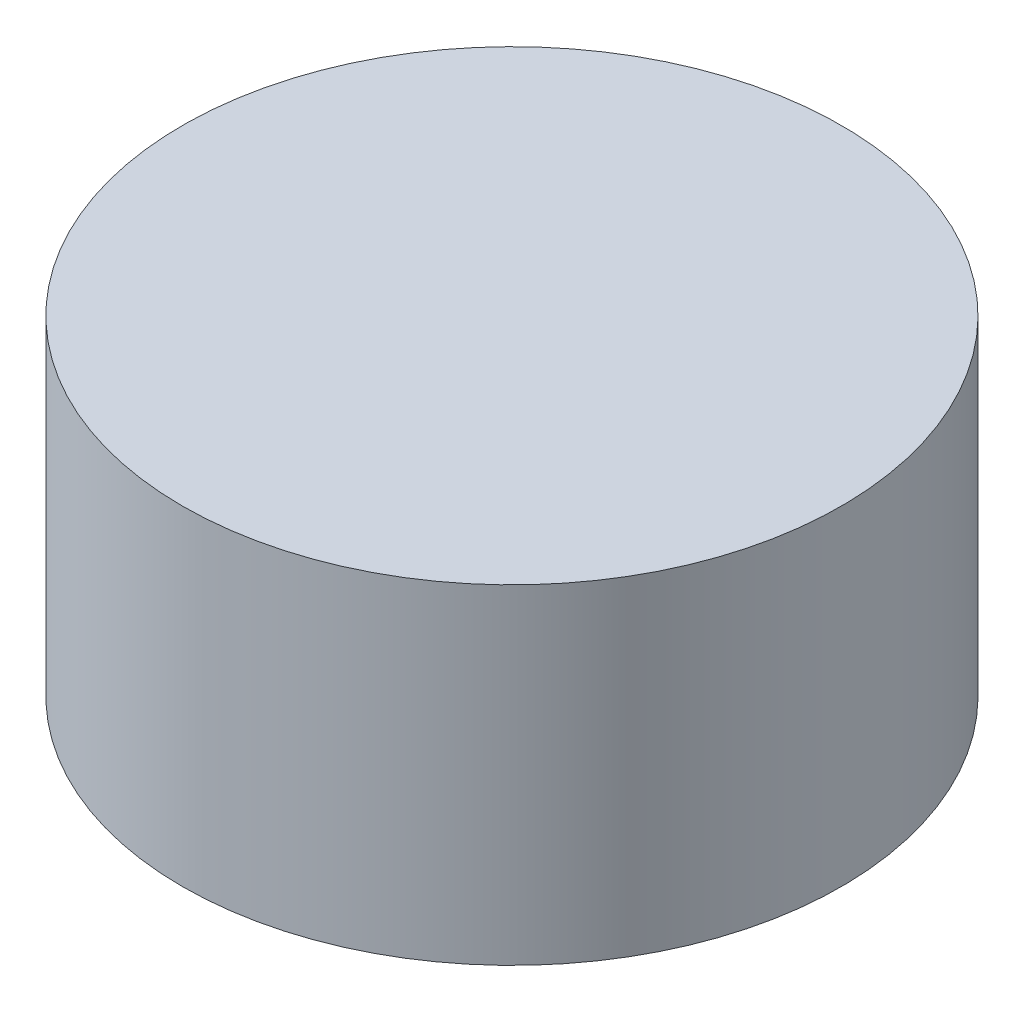
ISO-10303-21;
HEADER;
FILE_DESCRIPTION(('STEP AP214'),'2;1');
FILE_NAME('part.step','',(''),(''),'','','');
FILE_SCHEMA(('AUTOMOTIVE_DESIGN { 1 0 10303 214 1 1 1 1 }'));
ENDSEC;
DATA;
#1=APPLICATION_CONTEXT('core data for automotive mechanical design processes');
#2=APPLICATION_PROTOCOL_DEFINITION('international standard','automotive_design',2000,#1);
#3=PRODUCT_CONTEXT('',#1,'mechanical');
#4=PRODUCT('Part','Part','',(#3));
#5=PRODUCT_RELATED_PRODUCT_CATEGORY('part','',(#4));
#6=PRODUCT_DEFINITION_FORMATION('','',#4);
#7=PRODUCT_DEFINITION_CONTEXT('part definition',#1,'design');
#8=PRODUCT_DEFINITION('design','',#6,#7);
#9=PRODUCT_DEFINITION_SHAPE('','',#8);
#10=(LENGTH_UNIT() NAMED_UNIT(*) SI_UNIT(.MILLI.,.METRE.));
#11=(NAMED_UNIT(*) PLANE_ANGLE_UNIT() SI_UNIT($,.RADIAN.));
#12=(NAMED_UNIT(*) SI_UNIT($,.STERADIAN.) SOLID_ANGLE_UNIT());
#13=UNCERTAINTY_MEASURE_WITH_UNIT(LENGTH_MEASURE(1.E-05),#10,'distance_accuracy_value','');
#14=(GEOMETRIC_REPRESENTATION_CONTEXT(3) GLOBAL_UNCERTAINTY_ASSIGNED_CONTEXT((#13)) GLOBAL_UNIT_ASSIGNED_CONTEXT((#10,
#11,#12)) REPRESENTATION_CONTEXT('',''));
#15=CARTESIAN_POINT('',(0.,0.,0.));
#16=DIRECTION('',(0.,0.,1.));
#17=DIRECTION('',(1.,0.,0.));
#18=AXIS2_PLACEMENT_3D('',#15,#16,#17);
#19=CARTESIAN_POINT('',(0.,1.5875,0.));
#20=DIRECTION('',(0.,-1.,0.));
#21=DIRECTION('',(0.,0.,-1.));
#22=AXIS2_PLACEMENT_3D('',#19,#20,#21);
#23=CYLINDRICAL_SURFACE('',#22,3.175);
#24=CARTESIAN_POINT('',(0.,1.5875,0.));
#25=DIRECTION('',(0.,1.,0.));
#26=DIRECTION('',(0.,0.,1.));
#27=AXIS2_PLACEMENT_3D('',#24,#25,#26);
#28=CIRCLE('',#27,3.175);
#29=CARTESIAN_POINT('',(0.,1.5875,3.175));
#30=VERTEX_POINT('',#29);
#31=EDGE_CURVE('E10',#30,#30,#28,.T.);
#32=ORIENTED_EDGE('',*,*,#31,.F.);
#33=EDGE_LOOP('',(#32));
#34=FACE_BOUND('',#33,.T.);
#35=CARTESIAN_POINT('',(0.,-1.5875,0.));
#36=DIRECTION('',(0.,1.,0.));
#37=DIRECTION('',(0.,0.,1.));
#38=AXIS2_PLACEMENT_3D('',#35,#36,#37);
#39=CIRCLE('',#38,3.175);
#40=CARTESIAN_POINT('',(0.,-1.5875,3.175));
#41=VERTEX_POINT('',#40);
#42=EDGE_CURVE('E34',#41,#41,#39,.T.);
#43=ORIENTED_EDGE('',*,*,#42,.T.);
#44=EDGE_LOOP('',(#43));
#45=FACE_BOUND('',#44,.T.);
#46=ADVANCED_FACE('F31',(#34,#45),#23,.T.);
#47=CARTESIAN_POINT('',(0.,1.5875,0.));
#48=DIRECTION('',(0.,1.,0.));
#49=DIRECTION('',(0.,0.,1.));
#50=AXIS2_PLACEMENT_3D('',#47,#48,#49);
#51=PLANE('',#50);
#52=ORIENTED_EDGE('',*,*,#31,.T.);
#53=EDGE_LOOP('',(#52));
#54=FACE_BOUND('',#53,.T.);
#55=ADVANCED_FACE('F46',(#54),#51,.T.);
#56=CARTESIAN_POINT('',(0.,-1.5875,0.));
#57=DIRECTION('',(0.,1.,0.));
#58=DIRECTION('',(0.,0.,1.));
#59=AXIS2_PLACEMENT_3D('',#56,#57,#58);
#60=PLANE('',#59);
#61=ORIENTED_EDGE('',*,*,#42,.F.);
#62=EDGE_LOOP('',(#61));
#63=FACE_BOUND('',#62,.T.);
#64=ADVANCED_FACE('F44',(#63),#60,.F.);
#65=CLOSED_SHELL('',(#46,#55,#64));
#66=MANIFOLD_SOLID_BREP('B2',#65);
#67=ADVANCED_BREP_SHAPE_REPRESENTATION('',(#18,#66),#14);
#68=SHAPE_DEFINITION_REPRESENTATION(#9,#67);
ENDSEC;
END-ISO-10303-21;
